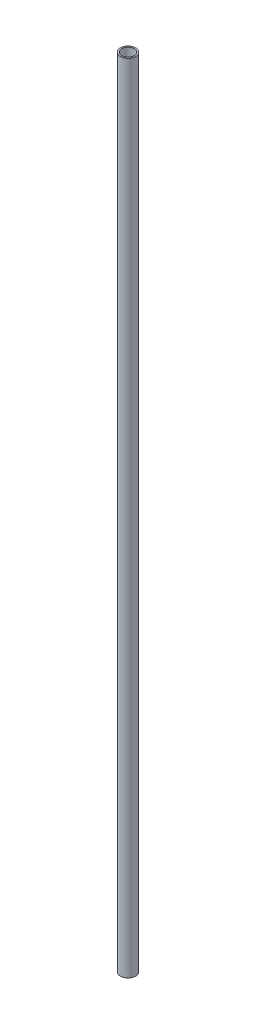
ISO-10303-21;
HEADER;
FILE_DESCRIPTION(('STEP AP214'),'2;1');
FILE_NAME('part.step','',(''),(''),'','','');
FILE_SCHEMA(('AUTOMOTIVE_DESIGN { 1 0 10303 214 1 1 1 1 }'));
ENDSEC;
DATA;
#1=APPLICATION_CONTEXT('core data for automotive mechanical design processes');
#2=APPLICATION_PROTOCOL_DEFINITION('international standard','automotive_design',2000,#1);
#3=PRODUCT_CONTEXT('',#1,'mechanical');
#4=PRODUCT('Part','Part','',(#3));
#5=PRODUCT_RELATED_PRODUCT_CATEGORY('part','',(#4));
#6=PRODUCT_DEFINITION_FORMATION('','',#4);
#7=PRODUCT_DEFINITION_CONTEXT('part definition',#1,'design');
#8=PRODUCT_DEFINITION('design','',#6,#7);
#9=PRODUCT_DEFINITION_SHAPE('','',#8);
#10=(LENGTH_UNIT() NAMED_UNIT(*) SI_UNIT(.MILLI.,.METRE.));
#11=(NAMED_UNIT(*) PLANE_ANGLE_UNIT() SI_UNIT($,.RADIAN.));
#12=(NAMED_UNIT(*) SI_UNIT($,.STERADIAN.) SOLID_ANGLE_UNIT());
#13=UNCERTAINTY_MEASURE_WITH_UNIT(LENGTH_MEASURE(1.E-05),#10,'distance_accuracy_value','');
#14=(GEOMETRIC_REPRESENTATION_CONTEXT(3) GLOBAL_UNCERTAINTY_ASSIGNED_CONTEXT((#13)) GLOBAL_UNIT_ASSIGNED_CONTEXT((#10,
#11,#12)) REPRESENTATION_CONTEXT('',''));
#15=CARTESIAN_POINT('',(0.,0.,0.));
#16=DIRECTION('',(0.,0.,1.));
#17=DIRECTION('',(1.,0.,0.));
#18=AXIS2_PLACEMENT_3D('',#15,#16,#17);
#19=CARTESIAN_POINT('',(0.,0.,0.));
#20=DIRECTION('',(0.,-1.,0.));
#21=DIRECTION('',(0.,0.,-1.));
#22=AXIS2_PLACEMENT_3D('',#19,#20,#21);
#23=CYLINDRICAL_SURFACE('',#22,3.87349999999997);
#24=CARTESIAN_POINT('',(0.,0.,0.));
#25=DIRECTION('',(0.,-1.,0.));
#26=DIRECTION('',(0.,0.,-1.));
#27=AXIS2_PLACEMENT_3D('',#24,#25,#26);
#28=CIRCLE('',#27,3.8735);
#29=CARTESIAN_POINT('',(0.,0.,-3.8735));
#30=VERTEX_POINT('',#29);
#31=EDGE_CURVE('E10',#30,#30,#28,.T.);
#32=ORIENTED_EDGE('',*,*,#31,.T.);
#33=EDGE_LOOP('',(#32));
#34=FACE_BOUND('',#33,.T.);
#35=CARTESIAN_POINT('',(0.,500.,0.));
#36=DIRECTION('',(0.,-1.,0.));
#37=DIRECTION('',(0.,0.,-1.));
#38=AXIS2_PLACEMENT_3D('',#35,#36,#37);
#39=CIRCLE('',#38,3.87349999999994);
#40=CARTESIAN_POINT('',(0.,500.,-3.87349999999994));
#41=VERTEX_POINT('',#40);
#42=EDGE_CURVE('E54',#41,#41,#39,.T.);
#43=ORIENTED_EDGE('',*,*,#42,.F.);
#44=EDGE_LOOP('',(#43));
#45=FACE_BOUND('',#44,.T.);
#46=ADVANCED_FACE('F37',(#34,#45),#23,.F.);
#47=CARTESIAN_POINT('',(3.8735,0.,0.));
#48=DIRECTION('',(0.,-1.,0.));
#49=DIRECTION('',(0.,0.,-1.));
#50=AXIS2_PLACEMENT_3D('',#47,#48,#49);
#51=PLANE('',#50);
#52=CARTESIAN_POINT('',(0.,0.,0.));
#53=DIRECTION('',(0.,-1.,0.));
#54=DIRECTION('',(0.,0.,-1.));
#55=AXIS2_PLACEMENT_3D('',#52,#53,#54);
#56=CIRCLE('',#55,4.7625);
#57=CARTESIAN_POINT('',(0.,0.,-4.7625));
#58=VERTEX_POINT('',#57);
#59=EDGE_CURVE('E44',#58,#58,#56,.T.);
#60=ORIENTED_EDGE('',*,*,#59,.T.);
#61=EDGE_LOOP('',(#60));
#62=FACE_BOUND('',#61,.T.);
#63=ORIENTED_EDGE('',*,*,#31,.F.);
#64=EDGE_LOOP('',(#63));
#65=FACE_BOUND('',#64,.T.);
#66=ADVANCED_FACE('F65',(#62,#65),#51,.T.);
#67=CARTESIAN_POINT('',(0.,0.,0.));
#68=DIRECTION('',(0.,-1.,0.));
#69=DIRECTION('',(0.,0.,-1.));
#70=AXIS2_PLACEMENT_3D('',#67,#68,#69);
#71=CYLINDRICAL_SURFACE('',#70,4.7625);
#72=CARTESIAN_POINT('',(0.,500.,0.));
#73=DIRECTION('',(0.,-1.,0.));
#74=DIRECTION('',(0.,0.,-1.));
#75=AXIS2_PLACEMENT_3D('',#72,#73,#74);
#76=CIRCLE('',#75,4.7625);
#77=CARTESIAN_POINT('',(0.,500.,-4.7625));
#78=VERTEX_POINT('',#77);
#79=EDGE_CURVE('E49',#78,#78,#76,.T.);
#80=ORIENTED_EDGE('',*,*,#79,.T.);
#81=EDGE_LOOP('',(#80));
#82=FACE_BOUND('',#81,.T.);
#83=ORIENTED_EDGE('',*,*,#59,.F.);
#84=EDGE_LOOP('',(#83));
#85=FACE_BOUND('',#84,.T.);
#86=ADVANCED_FACE('F69',(#82,#85),#71,.T.);
#87=CARTESIAN_POINT('',(4.7625,500.,0.));
#88=DIRECTION('',(0.,1.,0.));
#89=DIRECTION('',(0.,0.,1.));
#90=AXIS2_PLACEMENT_3D('',#87,#88,#89);
#91=PLANE('',#90);
#92=ORIENTED_EDGE('',*,*,#42,.T.);
#93=EDGE_LOOP('',(#92));
#94=FACE_BOUND('',#93,.T.);
#95=ORIENTED_EDGE('',*,*,#79,.F.);
#96=EDGE_LOOP('',(#95));
#97=FACE_BOUND('',#96,.T.);
#98=ADVANCED_FACE('F61',(#94,#97),#91,.T.);
#99=CLOSED_SHELL('',(#46,#66,#86,#98));
#100=MANIFOLD_SOLID_BREP('B2',#99);
#101=ADVANCED_BREP_SHAPE_REPRESENTATION('',(#18,#100),#14);
#102=SHAPE_DEFINITION_REPRESENTATION(#9,#101);
ENDSEC;
END-ISO-10303-21;
